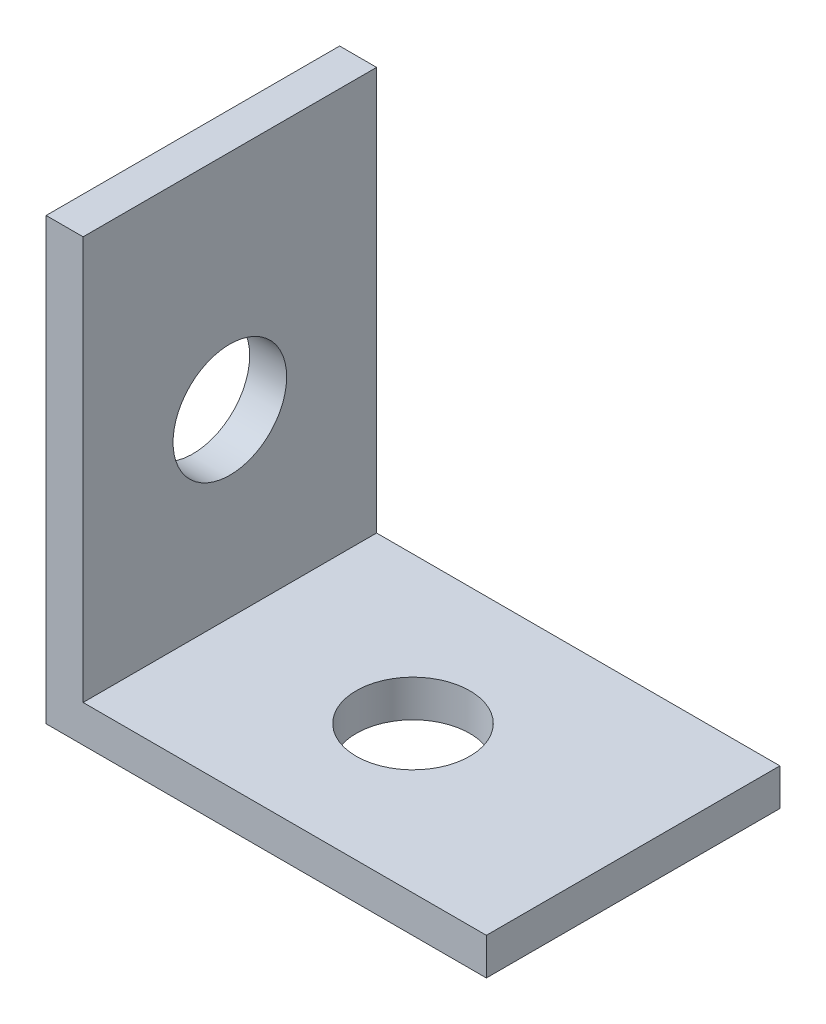
ISO-10303-21;
HEADER;
FILE_DESCRIPTION(('STEP AP214'),'2;1');
FILE_NAME('part.step','',(''),(''),'','','');
FILE_SCHEMA(('AUTOMOTIVE_DESIGN { 1 0 10303 214 1 1 1 1 }'));
ENDSEC;
DATA;
#1=APPLICATION_CONTEXT('core data for automotive mechanical design processes');
#2=APPLICATION_PROTOCOL_DEFINITION('international standard','automotive_design',2000,#1);
#3=PRODUCT_CONTEXT('',#1,'mechanical');
#4=PRODUCT('Part','Part','',(#3));
#5=PRODUCT_RELATED_PRODUCT_CATEGORY('part','',(#4));
#6=PRODUCT_DEFINITION_FORMATION('','',#4);
#7=PRODUCT_DEFINITION_CONTEXT('part definition',#1,'design');
#8=PRODUCT_DEFINITION('design','',#6,#7);
#9=PRODUCT_DEFINITION_SHAPE('','',#8);
#10=(LENGTH_UNIT() NAMED_UNIT(*) SI_UNIT(.MILLI.,.METRE.));
#11=(NAMED_UNIT(*) PLANE_ANGLE_UNIT() SI_UNIT($,.RADIAN.));
#12=(NAMED_UNIT(*) SI_UNIT($,.STERADIAN.) SOLID_ANGLE_UNIT());
#13=UNCERTAINTY_MEASURE_WITH_UNIT(LENGTH_MEASURE(1.E-05),#10,'distance_accuracy_value','');
#14=(GEOMETRIC_REPRESENTATION_CONTEXT(3) GLOBAL_UNCERTAINTY_ASSIGNED_CONTEXT((#13)) GLOBAL_UNIT_ASSIGNED_CONTEXT((#10,
#11,#12)) REPRESENTATION_CONTEXT('',''));
#15=CARTESIAN_POINT('',(0.,0.,0.));
#16=DIRECTION('',(0.,0.,1.));
#17=DIRECTION('',(1.,0.,0.));
#18=AXIS2_PLACEMENT_3D('',#15,#16,#17);
#19=CARTESIAN_POINT('',(-1.85240954406193,16.0366506389795,12.7));
#20=DIRECTION('',(0.,-1.,0.));
#21=DIRECTION('',(0.,0.,-1.));
#22=AXIS2_PLACEMENT_3D('',#19,#20,#21);
#23=PLANE('',#22);
#24=DIRECTION('',(-1.,0.,0.));
#25=VECTOR('',#24,1.);
#26=CARTESIAN_POINT('',(-1.85240954406193,16.0366506389795,0.));
#27=LINE('',#26,#25);
#28=CARTESIAN_POINT('',(-1.85240954406193,16.0366506389795,0.));
#29=VERTEX_POINT('',#28);
#30=CARTESIAN_POINT('',(-3.45260954406193,16.0366506389795,0.));
#31=VERTEX_POINT('',#30);
#32=EDGE_CURVE('E121',#29,#31,#27,.T.);
#33=ORIENTED_EDGE('',*,*,#32,.T.);
#34=DIRECTION('',(0.,0.,-1.));
#35=VECTOR('',#34,1.);
#36=CARTESIAN_POINT('',(-3.45260954406193,16.0366506389795,12.7));
#37=LINE('',#36,#35);
#38=CARTESIAN_POINT('',(-3.45260954406193,16.0366506389795,12.7));
#39=VERTEX_POINT('',#38);
#40=EDGE_CURVE('E11',#39,#31,#37,.T.);
#41=ORIENTED_EDGE('',*,*,#40,.F.);
#42=DIRECTION('',(-1.,0.,0.));
#43=VECTOR('',#42,1.);
#44=CARTESIAN_POINT('',(-1.85240954406193,16.0366506389795,12.7));
#45=LINE('',#44,#43);
#46=CARTESIAN_POINT('',(-1.85240954406193,16.0366506389795,12.7));
#47=VERTEX_POINT('',#46);
#48=EDGE_CURVE('E132',#47,#39,#45,.T.);
#49=ORIENTED_EDGE('',*,*,#48,.F.);
#50=DIRECTION('',(0.,0.,-1.));
#51=VECTOR('',#50,1.);
#52=CARTESIAN_POINT('',(-1.85240954406193,16.0366506389795,12.7));
#53=LINE('',#52,#51);
#54=EDGE_CURVE('E117',#47,#29,#53,.T.);
#55=ORIENTED_EDGE('',*,*,#54,.T.);
#56=EDGE_LOOP('',(#33,#41,#49,#55));
#57=FACE_BOUND('',#56,.T.);
#58=ADVANCED_FACE('F37',(#57),#23,.F.);
#59=CARTESIAN_POINT('',(-3.45260954406193,16.0366506389795,12.7));
#60=DIRECTION('',(1.,0.,0.));
#61=DIRECTION('',(0.,1.,0.));
#62=AXIS2_PLACEMENT_3D('',#59,#60,#61);
#63=PLANE('',#62);
#64=CARTESIAN_POINT('',(-3.45260954406193,6.38465063897954,6.35));
#65=DIRECTION('',(1.,0.,0.));
#66=DIRECTION('',(0.,0.,-1.));
#67=AXIS2_PLACEMENT_3D('',#64,#65,#66);
#68=CIRCLE('',#67,2.45745);
#69=CARTESIAN_POINT('',(-3.45260954406193,6.38465063897954,3.89255));
#70=VERTEX_POINT('',#69);
#71=EDGE_CURVE('E230',#70,#70,#68,.T.);
#72=ORIENTED_EDGE('',*,*,#71,.T.);
#73=EDGE_LOOP('',(#72));
#74=FACE_BOUND('',#73,.T.);
#75=DIRECTION('',(0.,-1.,0.));
#76=VECTOR('',#75,1.);
#77=CARTESIAN_POINT('',(-3.45260954406193,16.0366506389795,0.));
#78=LINE('',#77,#76);
#79=CARTESIAN_POINT('',(-3.45260954406193,-3.01334936102046,0.));
#80=VERTEX_POINT('',#79);
#81=EDGE_CURVE('E124',#31,#80,#78,.T.);
#82=ORIENTED_EDGE('',*,*,#81,.T.);
#83=DIRECTION('',(0.,0.,-1.));
#84=VECTOR('',#83,1.);
#85=CARTESIAN_POINT('',(-3.45260954406193,-3.01334936102046,12.7));
#86=LINE('',#85,#84);
#87=CARTESIAN_POINT('',(-3.45260954406193,-3.01334936102046,12.7));
#88=VERTEX_POINT('',#87);
#89=EDGE_CURVE('E45',#88,#80,#86,.T.);
#90=ORIENTED_EDGE('',*,*,#89,.F.);
#91=DIRECTION('',(0.,-1.,0.));
#92=VECTOR('',#91,1.);
#93=CARTESIAN_POINT('',(-3.45260954406193,16.0366506389795,12.7));
#94=LINE('',#93,#92);
#95=EDGE_CURVE('E90',#39,#88,#94,.T.);
#96=ORIENTED_EDGE('',*,*,#95,.F.);
#97=ORIENTED_EDGE('',*,*,#40,.T.);
#98=EDGE_LOOP('',(#82,#90,#96,#97));
#99=FACE_BOUND('',#98,.T.);
#100=ADVANCED_FACE('F159',(#74,#99),#63,.F.);
#101=CARTESIAN_POINT('',(-3.45260954406193,-3.01334936102046,12.7));
#102=DIRECTION('',(0.,1.,0.));
#103=DIRECTION('',(0.,0.,1.));
#104=AXIS2_PLACEMENT_3D('',#101,#102,#103);
#105=PLANE('',#104);
#106=CARTESIAN_POINT('',(6.07239045593808,-3.01334936102046,6.35));
#107=DIRECTION('',(0.,1.,0.));
#108=DIRECTION('',(0.,0.,1.));
#109=AXIS2_PLACEMENT_3D('',#106,#107,#108);
#110=CIRCLE('',#109,2.45745);
#111=CARTESIAN_POINT('',(6.07239045593808,-3.01334936102046,8.80745));
#112=VERTEX_POINT('',#111);
#113=EDGE_CURVE('E125',#112,#112,#110,.T.);
#114=ORIENTED_EDGE('',*,*,#113,.T.);
#115=EDGE_LOOP('',(#114));
#116=FACE_BOUND('',#115,.T.);
#117=DIRECTION('',(1.,0.,0.));
#118=VECTOR('',#117,1.);
#119=CARTESIAN_POINT('',(-3.45260954406193,-3.01334936102046,0.));
#120=LINE('',#119,#118);
#121=CARTESIAN_POINT('',(15.5973904559381,-3.01334936102046,0.));
#122=VERTEX_POINT('',#121);
#123=EDGE_CURVE('E127',#80,#122,#120,.T.);
#124=ORIENTED_EDGE('',*,*,#123,.T.);
#125=DIRECTION('',(0.,0.,-1.));
#126=VECTOR('',#125,1.);
#127=CARTESIAN_POINT('',(15.5973904559381,-3.01334936102046,12.7));
#128=LINE('',#127,#126);
#129=CARTESIAN_POINT('',(15.5973904559381,-3.01334936102046,12.7));
#130=VERTEX_POINT('',#129);
#131=EDGE_CURVE('E112',#130,#122,#128,.T.);
#132=ORIENTED_EDGE('',*,*,#131,.F.);
#133=DIRECTION('',(1.,0.,0.));
#134=VECTOR('',#133,1.);
#135=CARTESIAN_POINT('',(-3.45260954406193,-3.01334936102046,12.7));
#136=LINE('',#135,#134);
#137=EDGE_CURVE('E103',#88,#130,#136,.T.);
#138=ORIENTED_EDGE('',*,*,#137,.F.);
#139=ORIENTED_EDGE('',*,*,#89,.T.);
#140=EDGE_LOOP('',(#124,#132,#138,#139));
#141=FACE_BOUND('',#140,.T.);
#142=ADVANCED_FACE('F138',(#116,#141),#105,.F.);
#143=CARTESIAN_POINT('',(15.5973904559381,-3.01334936102046,12.7));
#144=DIRECTION('',(-1.,0.,0.));
#145=DIRECTION('',(0.,0.,1.));
#146=AXIS2_PLACEMENT_3D('',#143,#144,#145);
#147=PLANE('',#146);
#148=DIRECTION('',(0.,1.,0.));
#149=VECTOR('',#148,1.);
#150=CARTESIAN_POINT('',(15.5973904559381,-3.01334936102046,0.));
#151=LINE('',#150,#149);
#152=CARTESIAN_POINT('',(15.5973904559381,-1.41314936102046,0.));
#153=VERTEX_POINT('',#152);
#154=EDGE_CURVE('E111',#122,#153,#151,.T.);
#155=ORIENTED_EDGE('',*,*,#154,.T.);
#156=DIRECTION('',(0.,0.,-1.));
#157=VECTOR('',#156,1.);
#158=CARTESIAN_POINT('',(15.5973904559381,-1.41314936102046,12.7));
#159=LINE('',#158,#157);
#160=CARTESIAN_POINT('',(15.5973904559381,-1.41314936102046,12.7));
#161=VERTEX_POINT('',#160);
#162=EDGE_CURVE('E108',#161,#153,#159,.T.);
#163=ORIENTED_EDGE('',*,*,#162,.F.);
#164=DIRECTION('',(0.,1.,0.));
#165=VECTOR('',#164,1.);
#166=CARTESIAN_POINT('',(15.5973904559381,-3.01334936102046,12.7));
#167=LINE('',#166,#165);
#168=EDGE_CURVE('E97',#130,#161,#167,.T.);
#169=ORIENTED_EDGE('',*,*,#168,.F.);
#170=ORIENTED_EDGE('',*,*,#131,.T.);
#171=EDGE_LOOP('',(#155,#163,#169,#170));
#172=FACE_BOUND('',#171,.T.);
#173=ADVANCED_FACE('F109',(#172),#147,.F.);
#174=CARTESIAN_POINT('',(15.5973904559381,-1.41314936102046,12.7));
#175=DIRECTION('',(0.,-1.,0.));
#176=DIRECTION('',(0.,0.,-1.));
#177=AXIS2_PLACEMENT_3D('',#174,#175,#176);
#178=PLANE('',#177);
#179=CARTESIAN_POINT('',(6.07239045593808,-1.41314936102046,6.35));
#180=DIRECTION('',(0.,1.,0.));
#181=DIRECTION('',(0.,0.,1.));
#182=AXIS2_PLACEMENT_3D('',#179,#180,#181);
#183=CIRCLE('',#182,2.45745);
#184=CARTESIAN_POINT('',(6.07239045593808,-1.41314936102046,8.80745));
#185=VERTEX_POINT('',#184);
#186=EDGE_CURVE('E234',#185,#185,#183,.T.);
#187=ORIENTED_EDGE('',*,*,#186,.F.);
#188=EDGE_LOOP('',(#187));
#189=FACE_BOUND('',#188,.T.);
#190=DIRECTION('',(-1.,0.,0.));
#191=VECTOR('',#190,1.);
#192=CARTESIAN_POINT('',(15.5973904559381,-1.41314936102046,0.));
#193=LINE('',#192,#191);
#194=CARTESIAN_POINT('',(-1.85240954406193,-1.41314936102046,0.));
#195=VERTEX_POINT('',#194);
#196=EDGE_CURVE('E76',#153,#195,#193,.T.);
#197=ORIENTED_EDGE('',*,*,#196,.T.);
#198=DIRECTION('',(0.,0.,-1.));
#199=VECTOR('',#198,1.);
#200=CARTESIAN_POINT('',(-1.85240954406193,-1.41314936102046,12.7));
#201=LINE('',#200,#199);
#202=CARTESIAN_POINT('',(-1.85240954406193,-1.41314936102046,12.7));
#203=VERTEX_POINT('',#202);
#204=EDGE_CURVE('E113',#203,#195,#201,.T.);
#205=ORIENTED_EDGE('',*,*,#204,.F.);
#206=DIRECTION('',(-1.,0.,0.));
#207=VECTOR('',#206,1.);
#208=CARTESIAN_POINT('',(15.5973904559381,-1.41314936102046,12.7));
#209=LINE('',#208,#207);
#210=EDGE_CURVE('E101',#161,#203,#209,.T.);
#211=ORIENTED_EDGE('',*,*,#210,.F.);
#212=ORIENTED_EDGE('',*,*,#162,.T.);
#213=EDGE_LOOP('',(#197,#205,#211,#212));
#214=FACE_BOUND('',#213,.T.);
#215=ADVANCED_FACE('F115',(#189,#214),#178,.F.);
#216=CARTESIAN_POINT('',(-1.85240954406193,-1.41314936102046,12.7));
#217=DIRECTION('',(-1.,0.,0.));
#218=DIRECTION('',(0.,-1.,0.));
#219=AXIS2_PLACEMENT_3D('',#216,#217,#218);
#220=PLANE('',#219);
#221=CARTESIAN_POINT('',(-1.85240954406193,6.38465063897954,6.35));
#222=DIRECTION('',(1.,0.,0.));
#223=DIRECTION('',(0.,0.,-1.));
#224=AXIS2_PLACEMENT_3D('',#221,#222,#223);
#225=CIRCLE('',#224,2.45744999999999);
#226=CARTESIAN_POINT('',(-1.85240954406193,6.38465063897954,3.89255000000001));
#227=VERTEX_POINT('',#226);
#228=EDGE_CURVE('E232',#227,#227,#225,.T.);
#229=ORIENTED_EDGE('',*,*,#228,.F.);
#230=EDGE_LOOP('',(#229));
#231=FACE_BOUND('',#230,.T.);
#232=DIRECTION('',(0.,1.,0.));
#233=VECTOR('',#232,1.);
#234=CARTESIAN_POINT('',(-1.85240954406193,-1.41314936102046,0.));
#235=LINE('',#234,#233);
#236=EDGE_CURVE('E82',#195,#29,#235,.T.);
#237=ORIENTED_EDGE('',*,*,#236,.T.);
#238=ORIENTED_EDGE('',*,*,#54,.F.);
#239=DIRECTION('',(0.,1.,0.));
#240=VECTOR('',#239,1.);
#241=CARTESIAN_POINT('',(-1.85240954406193,-1.41314936102046,12.7));
#242=LINE('',#241,#240);
#243=EDGE_CURVE('E53',#203,#47,#242,.T.);
#244=ORIENTED_EDGE('',*,*,#243,.F.);
#245=ORIENTED_EDGE('',*,*,#204,.T.);
#246=EDGE_LOOP('',(#237,#238,#244,#245));
#247=FACE_BOUND('',#246,.T.);
#248=ADVANCED_FACE('F145',(#231,#247),#220,.F.);
#249=CARTESIAN_POINT('',(0.,0.,12.7));
#250=DIRECTION('',(0.,0.,1.));
#251=DIRECTION('',(1.,0.,0.));
#252=AXIS2_PLACEMENT_3D('',#249,#250,#251);
#253=PLANE('',#252);
#254=ORIENTED_EDGE('',*,*,#48,.T.);
#255=ORIENTED_EDGE('',*,*,#95,.T.);
#256=ORIENTED_EDGE('',*,*,#137,.T.);
#257=ORIENTED_EDGE('',*,*,#168,.T.);
#258=ORIENTED_EDGE('',*,*,#210,.T.);
#259=ORIENTED_EDGE('',*,*,#243,.T.);
#260=EDGE_LOOP('',(#254,#255,#256,#257,#258,#259));
#261=FACE_BOUND('',#260,.T.);
#262=ADVANCED_FACE('F99',(#261),#253,.T.);
#263=CARTESIAN_POINT('',(0.,0.,0.));
#264=DIRECTION('',(0.,0.,1.));
#265=DIRECTION('',(1.,0.,0.));
#266=AXIS2_PLACEMENT_3D('',#263,#264,#265);
#267=PLANE('',#266);
#268=ORIENTED_EDGE('',*,*,#32,.F.);
#269=ORIENTED_EDGE('',*,*,#236,.F.);
#270=ORIENTED_EDGE('',*,*,#196,.F.);
#271=ORIENTED_EDGE('',*,*,#154,.F.);
#272=ORIENTED_EDGE('',*,*,#123,.F.);
#273=ORIENTED_EDGE('',*,*,#81,.F.);
#274=EDGE_LOOP('',(#268,#269,#270,#271,#272,#273));
#275=FACE_BOUND('',#274,.T.);
#276=ADVANCED_FACE('F141',(#275),#267,.F.);
#277=CARTESIAN_POINT('',(6.07239045593808,-1.41314936102046,6.35));
#278=DIRECTION('',(0.,1.,0.));
#279=DIRECTION('',(0.,0.,1.));
#280=AXIS2_PLACEMENT_3D('',#277,#278,#279);
#281=CYLINDRICAL_SURFACE('',#280,2.45745);
#282=ORIENTED_EDGE('',*,*,#113,.F.);
#283=EDGE_LOOP('',(#282));
#284=FACE_BOUND('',#283,.T.);
#285=ORIENTED_EDGE('',*,*,#186,.T.);
#286=EDGE_LOOP('',(#285));
#287=FACE_BOUND('',#286,.T.);
#288=ADVANCED_FACE('F190',(#284,#287),#281,.F.);
#289=CARTESIAN_POINT('',(-1.85240954406193,6.38465063897954,6.35));
#290=DIRECTION('',(1.,0.,0.));
#291=DIRECTION('',(0.,0.,-1.));
#292=AXIS2_PLACEMENT_3D('',#289,#290,#291);
#293=CYLINDRICAL_SURFACE('',#292,2.45744999999999);
#294=ORIENTED_EDGE('',*,*,#71,.F.);
#295=EDGE_LOOP('',(#294));
#296=FACE_BOUND('',#295,.T.);
#297=ORIENTED_EDGE('',*,*,#228,.T.);
#298=EDGE_LOOP('',(#297));
#299=FACE_BOUND('',#298,.T.);
#300=ADVANCED_FACE('F194',(#296,#299),#293,.F.);
#301=CLOSED_SHELL('',(#58,#100,#142,#173,#215,#248,#262,#276,#288,#300));
#302=MANIFOLD_SOLID_BREP('B2',#301);
#303=ADVANCED_BREP_SHAPE_REPRESENTATION('',(#18,#302),#14);
#304=SHAPE_DEFINITION_REPRESENTATION(#9,#303);
ENDSEC;
END-ISO-10303-21;
